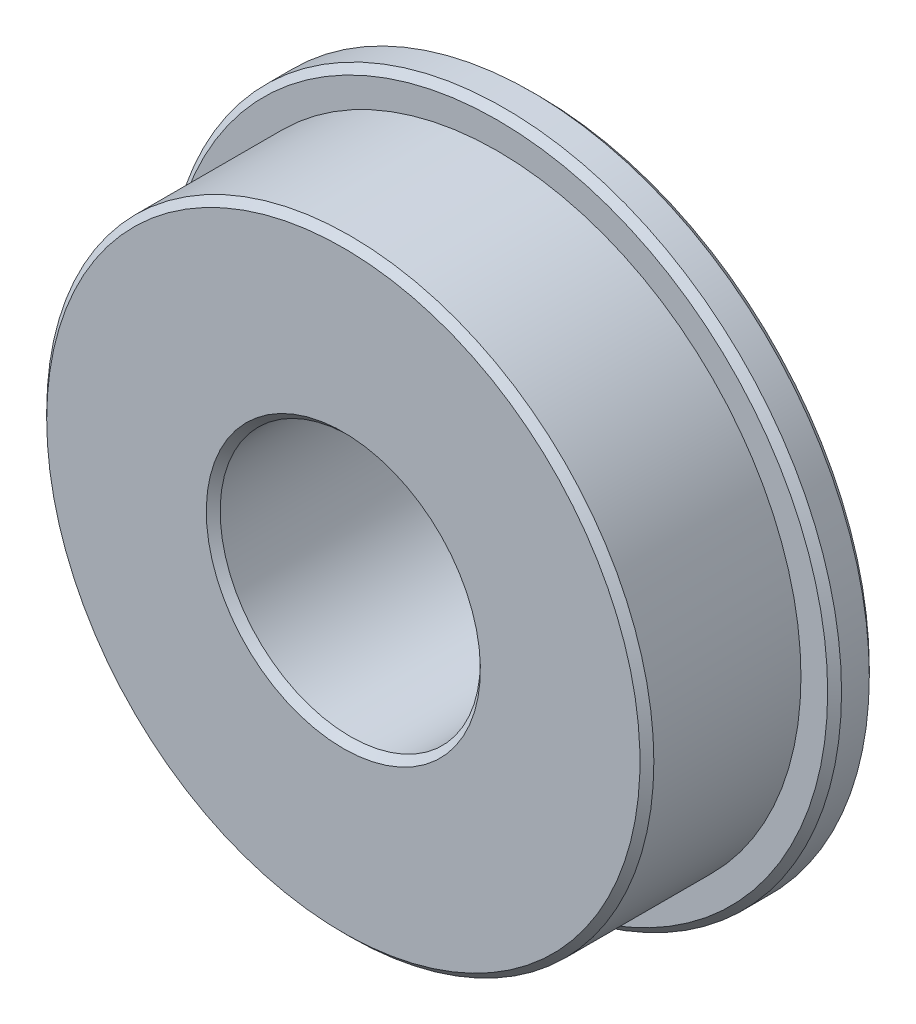
ISO-10303-21;
HEADER;
FILE_DESCRIPTION(('STEP AP214'),'2;1');
FILE_NAME('part.step','',(''),(''),'','','');
FILE_SCHEMA(('AUTOMOTIVE_DESIGN { 1 0 10303 214 1 1 1 1 }'));
ENDSEC;
DATA;
#1=APPLICATION_CONTEXT('core data for automotive mechanical design processes');
#2=APPLICATION_PROTOCOL_DEFINITION('international standard','automotive_design',2000,#1);
#3=PRODUCT_CONTEXT('',#1,'mechanical');
#4=PRODUCT('Part','Part','',(#3));
#5=PRODUCT_RELATED_PRODUCT_CATEGORY('part','',(#4));
#6=PRODUCT_DEFINITION_FORMATION('','',#4);
#7=PRODUCT_DEFINITION_CONTEXT('part definition',#1,'design');
#8=PRODUCT_DEFINITION('design','',#6,#7);
#9=PRODUCT_DEFINITION_SHAPE('','',#8);
#10=(LENGTH_UNIT() NAMED_UNIT(*) SI_UNIT(.MILLI.,.METRE.));
#11=(NAMED_UNIT(*) PLANE_ANGLE_UNIT() SI_UNIT($,.RADIAN.));
#12=(NAMED_UNIT(*) SI_UNIT($,.STERADIAN.) SOLID_ANGLE_UNIT());
#13=UNCERTAINTY_MEASURE_WITH_UNIT(LENGTH_MEASURE(1.E-05),#10,'distance_accuracy_value','');
#14=(GEOMETRIC_REPRESENTATION_CONTEXT(3) GLOBAL_UNCERTAINTY_ASSIGNED_CONTEXT((#13)) GLOBAL_UNIT_ASSIGNED_CONTEXT((#10,
#11,#12)) REPRESENTATION_CONTEXT('',''));
#15=CARTESIAN_POINT('',(0.,0.,0.));
#16=DIRECTION('',(0.,0.,1.));
#17=DIRECTION('',(1.,0.,0.));
#18=AXIS2_PLACEMENT_3D('',#15,#16,#17);
#19=CARTESIAN_POINT('',(-8.86153846153845,6.04195804195806,6.90880000000005));
#20=DIRECTION('',(0.,0.,-1.));
#21=DIRECTION('',(-1.,0.,0.));
#22=AXIS2_PLACEMENT_3D('',#19,#20,#21);
#23=CONICAL_SURFACE('',#22,11.1125,0.785398163397452);
#24=CARTESIAN_POINT('',(-8.86153846153845,6.04195804195806,7.16280000000004));
#25=DIRECTION('',(0.,0.,-1.));
#26=DIRECTION('',(-1.,0.,0.));
#27=AXIS2_PLACEMENT_3D('',#24,#25,#26);
#28=CIRCLE('',#27,10.8585);
#29=CARTESIAN_POINT('',(-19.7200384615385,6.04195804195806,7.16280000000004));
#30=VERTEX_POINT('',#29);
#31=EDGE_CURVE('E18',#30,#30,#28,.T.);
#32=ORIENTED_EDGE('',*,*,#31,.T.);
#33=EDGE_LOOP('',(#32));
#34=FACE_BOUND('',#33,.T.);
#35=CARTESIAN_POINT('',(-8.86153846153845,6.04195804195806,6.90880000000005));
#36=DIRECTION('',(0.,0.,1.));
#37=DIRECTION('',(1.,0.,0.));
#38=AXIS2_PLACEMENT_3D('',#35,#36,#37);
#39=CIRCLE('',#38,11.1125);
#40=CARTESIAN_POINT('',(2.25096153846156,6.04195804195806,6.90880000000005));
#41=VERTEX_POINT('',#40);
#42=EDGE_CURVE('E30',#41,#41,#39,.F.);
#43=ORIENTED_EDGE('',*,*,#42,.F.);
#44=EDGE_LOOP('',(#43));
#45=FACE_BOUND('',#44,.T.);
#46=ADVANCED_FACE('F15',(#34,#45),#23,.T.);
#47=CARTESIAN_POINT('',(-8.86153846153845,6.04195804195806,7.16280000000002));
#48=DIRECTION('',(0.,0.,1.));
#49=DIRECTION('',(1.,0.,0.));
#50=AXIS2_PLACEMENT_3D('',#47,#48,#49);
#51=CYLINDRICAL_SURFACE('',#50,11.1125);
#52=CARTESIAN_POINT('',(-8.86153846153845,6.04195804195806,1.52399999999997));
#53=DIRECTION('',(0.,0.,1.));
#54=DIRECTION('',(1.,0.,0.));
#55=AXIS2_PLACEMENT_3D('',#52,#53,#54);
#56=CIRCLE('',#55,11.1125);
#57=CARTESIAN_POINT('',(2.25096153846156,6.04195804195806,1.52399999999997));
#58=VERTEX_POINT('',#57);
#59=EDGE_CURVE('E39',#58,#58,#56,.T.);
#60=ORIENTED_EDGE('',*,*,#59,.T.);
#61=EDGE_LOOP('',(#60));
#62=FACE_BOUND('',#61,.T.);
#63=ORIENTED_EDGE('',*,*,#42,.T.);
#64=EDGE_LOOP('',(#63));
#65=FACE_BOUND('',#64,.T.);
#66=ADVANCED_FACE('F49',(#62,#65),#51,.T.);
#67=CARTESIAN_POINT('',(-8.86153846153845,6.04195804195806,7.16280000000002));
#68=DIRECTION('',(0.,0.,-1.));
#69=DIRECTION('',(-1.,0.,0.));
#70=AXIS2_PLACEMENT_3D('',#67,#68,#69);
#71=PLANE('',#70);
#72=ORIENTED_EDGE('',*,*,#31,.F.);
#73=EDGE_LOOP('',(#72));
#74=FACE_BOUND('',#73,.T.);
#75=CARTESIAN_POINT('',(-8.86153846153845,6.04195804195806,7.16280000011693));
#76=DIRECTION('',(0.,0.,1.));
#77=DIRECTION('',(0.,-1.,0.));
#78=AXIS2_PLACEMENT_3D('',#75,#76,#77);
#79=CIRCLE('',#78,5.01650000001817);
#80=CARTESIAN_POINT('',(-8.86153846153845,1.0254580419399,7.16280000011693));
#81=VERTEX_POINT('',#80);
#82=EDGE_CURVE('E37',#81,#81,#79,.F.);
#83=ORIENTED_EDGE('',*,*,#82,.T.);
#84=EDGE_LOOP('',(#83));
#85=FACE_BOUND('',#84,.T.);
#86=ADVANCED_FACE('F56',(#74,#85),#71,.F.);
#87=CARTESIAN_POINT('',(-8.86153846153845,6.04195804195806,1.52399999999997));
#88=DIRECTION('',(0.,0.,-1.));
#89=DIRECTION('',(-1.,0.,0.));
#90=AXIS2_PLACEMENT_3D('',#87,#88,#89);
#91=PLANE('',#90);
#92=ORIENTED_EDGE('',*,*,#59,.F.);
#93=EDGE_LOOP('',(#92));
#94=FACE_BOUND('',#93,.T.);
#95=CARTESIAN_POINT('',(-8.86153846153845,6.04195804195806,1.52399999999998));
#96=DIRECTION('',(0.,0.,-1.));
#97=DIRECTION('',(-1.,0.,0.));
#98=AXIS2_PLACEMENT_3D('',#95,#96,#97);
#99=CIRCLE('',#98,12.0904);
#100=CARTESIAN_POINT('',(-20.9519384615385,6.04195804195806,1.52399999999998));
#101=VERTEX_POINT('',#100);
#102=EDGE_CURVE('E33',#101,#101,#99,.T.);
#103=ORIENTED_EDGE('',*,*,#102,.F.);
#104=EDGE_LOOP('',(#103));
#105=FACE_BOUND('',#104,.T.);
#106=ADVANCED_FACE('F87',(#94,#105),#91,.F.);
#107=CARTESIAN_POINT('',(-8.86153846153845,6.04195804195806,7.16280000011693));
#108=DIRECTION('',(0.,0.,1.));
#109=DIRECTION('',(0.,-1.,0.));
#110=AXIS2_PLACEMENT_3D('',#107,#108,#109);
#111=CONICAL_SURFACE('',#110,5.01650000001817,0.785398163397448);
#112=CARTESIAN_POINT('',(-8.86153846153845,6.04195804195806,6.90880000000005));
#113=DIRECTION('',(0.,0.,1.));
#114=DIRECTION('',(1.,0.,0.));
#115=AXIS2_PLACEMENT_3D('',#112,#113,#114);
#116=CIRCLE('',#115,4.7625);
#117=CARTESIAN_POINT('',(-4.09903846153845,6.04195804195806,6.90880000000005));
#118=VERTEX_POINT('',#117);
#119=EDGE_CURVE('E36',#118,#118,#116,.F.);
#120=ORIENTED_EDGE('',*,*,#119,.T.);
#121=EDGE_LOOP('',(#120));
#122=FACE_BOUND('',#121,.T.);
#123=ORIENTED_EDGE('',*,*,#82,.F.);
#124=EDGE_LOOP('',(#123));
#125=FACE_BOUND('',#124,.T.);
#126=ADVANCED_FACE('F83',(#122,#125),#111,.F.);
#127=CARTESIAN_POINT('',(-8.86153846153845,6.04195804195806,1.27));
#128=DIRECTION('',(0.,0.,-1.));
#129=DIRECTION('',(-1.,0.,0.));
#130=AXIS2_PLACEMENT_3D('',#127,#128,#129);
#131=CONICAL_SURFACE('',#130,12.3444,0.78539816339745);
#132=CARTESIAN_POINT('',(-8.86153846153845,6.04195804195806,1.26999999999999));
#133=DIRECTION('',(0.,0.,1.));
#134=DIRECTION('',(1.,0.,0.));
#135=AXIS2_PLACEMENT_3D('',#132,#133,#134);
#136=CIRCLE('',#135,12.3444);
#137=CARTESIAN_POINT('',(3.48286153846156,6.04195804195806,1.26999999999999));
#138=VERTEX_POINT('',#137);
#139=EDGE_CURVE('E171',#138,#138,#136,.F.);
#140=ORIENTED_EDGE('',*,*,#139,.F.);
#141=EDGE_LOOP('',(#140));
#142=FACE_BOUND('',#141,.T.);
#143=ORIENTED_EDGE('',*,*,#102,.T.);
#144=EDGE_LOOP('',(#143));
#145=FACE_BOUND('',#144,.T.);
#146=ADVANCED_FACE('F79',(#142,#145),#131,.T.);
#147=CARTESIAN_POINT('',(-8.86153846153845,6.04195804195806,1.52399999999997));
#148=DIRECTION('',(0.,0.,1.));
#149=DIRECTION('',(1.,0.,0.));
#150=AXIS2_PLACEMENT_3D('',#147,#148,#149);
#151=CYLINDRICAL_SURFACE('',#150,4.7625);
#152=ORIENTED_EDGE('',*,*,#119,.F.);
#153=EDGE_LOOP('',(#152));
#154=FACE_BOUND('',#153,.T.);
#155=CARTESIAN_POINT('',(-8.86153846153845,6.04195804195806,0.253999999983989));
#156=DIRECTION('',(0.,0.,-1.));
#157=DIRECTION('',(-1.,0.,0.));
#158=AXIS2_PLACEMENT_3D('',#155,#156,#157);
#159=CIRCLE('',#158,4.76249999990543);
#160=CARTESIAN_POINT('',(-13.6240384614439,6.04195804195806,0.253999999983989));
#161=VERTEX_POINT('',#160);
#162=EDGE_CURVE('E173',#161,#161,#159,.T.);
#163=ORIENTED_EDGE('',*,*,#162,.T.);
#164=EDGE_LOOP('',(#163));
#165=FACE_BOUND('',#164,.T.);
#166=ADVANCED_FACE('F75',(#154,#165),#151,.F.);
#167=CARTESIAN_POINT('',(-8.86153846153845,6.04195804195806,1.52399999999997));
#168=DIRECTION('',(0.,0.,1.));
#169=DIRECTION('',(1.,0.,0.));
#170=AXIS2_PLACEMENT_3D('',#167,#168,#169);
#171=CYLINDRICAL_SURFACE('',#170,12.3444);
#172=CARTESIAN_POINT('',(-8.86153846153845,6.04195804195806,0.25399999999999));
#173=DIRECTION('',(0.,0.,1.));
#174=DIRECTION('',(1.,0.,0.));
#175=AXIS2_PLACEMENT_3D('',#172,#173,#174);
#176=CIRCLE('',#175,12.3444);
#177=CARTESIAN_POINT('',(3.48286153846154,6.04195804195807,0.25399999999999));
#178=VERTEX_POINT('',#177);
#179=EDGE_CURVE('E27',#178,#178,#176,.F.);
#180=ORIENTED_EDGE('',*,*,#179,.F.);
#181=EDGE_LOOP('',(#180));
#182=FACE_BOUND('',#181,.T.);
#183=ORIENTED_EDGE('',*,*,#139,.T.);
#184=EDGE_LOOP('',(#183));
#185=FACE_BOUND('',#184,.T.);
#186=ADVANCED_FACE('F71',(#182,#185),#171,.T.);
#187=CARTESIAN_POINT('',(-8.86153846153845,6.04195804195806,-5.6843418860808E-11));
#188=DIRECTION('',(0.,0.,-1.));
#189=DIRECTION('',(-1.,0.,0.));
#190=AXIS2_PLACEMENT_3D('',#187,#188,#189);
#191=CONICAL_SURFACE('',#190,5.01650000000311,0.785398163509345);
#192=ORIENTED_EDGE('',*,*,#162,.F.);
#193=EDGE_LOOP('',(#192));
#194=FACE_BOUND('',#193,.T.);
#195=CARTESIAN_POINT('',(-8.86153846153845,6.04195804195806,-6.43721187448625E-11));
#196=DIRECTION('',(0.,0.,-1.));
#197=DIRECTION('',(-1.,0.,0.));
#198=AXIS2_PLACEMENT_3D('',#195,#196,#197);
#199=CIRCLE('',#198,5.01650000001064);
#200=CARTESIAN_POINT('',(-13.8780384615491,6.04195804195806,-6.43721187448625E-11));
#201=VERTEX_POINT('',#200);
#202=EDGE_CURVE('E22',#201,#201,#199,.F.);
#203=ORIENTED_EDGE('',*,*,#202,.F.);
#204=EDGE_LOOP('',(#203));
#205=FACE_BOUND('',#204,.T.);
#206=ADVANCED_FACE('F64',(#194,#205),#191,.F.);
#207=CARTESIAN_POINT('',(-8.86153846153845,6.04195804195806,0.253999999999992));
#208=DIRECTION('',(0.,0.,1.));
#209=DIRECTION('',(1.,0.,0.));
#210=AXIS2_PLACEMENT_3D('',#207,#208,#209);
#211=CONICAL_SURFACE('',#210,12.3444,0.785398163397453);
#212=ORIENTED_EDGE('',*,*,#179,.T.);
#213=EDGE_LOOP('',(#212));
#214=FACE_BOUND('',#213,.T.);
#215=CARTESIAN_POINT('',(-8.86153846153845,6.04195804195806,0.));
#216=DIRECTION('',(0.,0.,1.));
#217=DIRECTION('',(1.,0.,0.));
#218=AXIS2_PLACEMENT_3D('',#215,#216,#217);
#219=CIRCLE('',#218,12.0904);
#220=CARTESIAN_POINT('',(3.22886153846155,6.04195804195806,0.));
#221=VERTEX_POINT('',#220);
#222=EDGE_CURVE('E10',#221,#221,#219,.F.);
#223=ORIENTED_EDGE('',*,*,#222,.F.);
#224=EDGE_LOOP('',(#223));
#225=FACE_BOUND('',#224,.T.);
#226=ADVANCED_FACE('F59',(#214,#225),#211,.T.);
#227=CARTESIAN_POINT('',(-8.86153846153845,6.04195804195806,0.));
#228=DIRECTION('',(0.,0.,-1.));
#229=DIRECTION('',(-1.,0.,0.));
#230=AXIS2_PLACEMENT_3D('',#227,#228,#229);
#231=PLANE('',#230);
#232=ORIENTED_EDGE('',*,*,#222,.T.);
#233=EDGE_LOOP('',(#232));
#234=FACE_BOUND('',#233,.T.);
#235=ORIENTED_EDGE('',*,*,#202,.T.);
#236=EDGE_LOOP('',(#235));
#237=FACE_BOUND('',#236,.T.);
#238=ADVANCED_FACE('F57',(#234,#237),#231,.T.);
#239=CLOSED_SHELL('',(#46,#66,#86,#106,#126,#146,#166,#186,#206,#226,#238));
#240=MANIFOLD_SOLID_BREP('B1',#239);
#241=ADVANCED_BREP_SHAPE_REPRESENTATION('',(#18,#240),#14);
#242=SHAPE_DEFINITION_REPRESENTATION(#9,#241);
ENDSEC;
END-ISO-10303-21;
